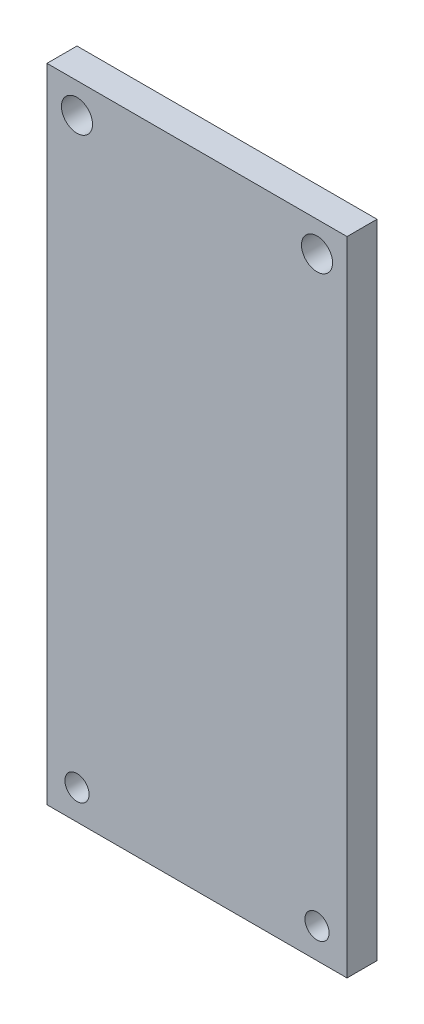
ISO-10303-21;
HEADER;
FILE_DESCRIPTION(('STEP AP214'),'2;1');
FILE_NAME('part.step','',(''),(''),'','','');
FILE_SCHEMA(('AUTOMOTIVE_DESIGN { 1 0 10303 214 1 1 1 1 }'));
ENDSEC;
DATA;
#1=APPLICATION_CONTEXT('core data for automotive mechanical design processes');
#2=APPLICATION_PROTOCOL_DEFINITION('international standard','automotive_design',2000,#1);
#3=PRODUCT_CONTEXT('',#1,'mechanical');
#4=PRODUCT('Part','Part','',(#3));
#5=PRODUCT_RELATED_PRODUCT_CATEGORY('part','',(#4));
#6=PRODUCT_DEFINITION_FORMATION('','',#4);
#7=PRODUCT_DEFINITION_CONTEXT('part definition',#1,'design');
#8=PRODUCT_DEFINITION('design','',#6,#7);
#9=PRODUCT_DEFINITION_SHAPE('','',#8);
#10=(LENGTH_UNIT() NAMED_UNIT(*) SI_UNIT(.MILLI.,.METRE.));
#11=(NAMED_UNIT(*) PLANE_ANGLE_UNIT() SI_UNIT($,.RADIAN.));
#12=(NAMED_UNIT(*) SI_UNIT($,.STERADIAN.) SOLID_ANGLE_UNIT());
#13=UNCERTAINTY_MEASURE_WITH_UNIT(LENGTH_MEASURE(1.E-05),#10,'distance_accuracy_value','');
#14=(GEOMETRIC_REPRESENTATION_CONTEXT(3) GLOBAL_UNCERTAINTY_ASSIGNED_CONTEXT((#13)) GLOBAL_UNIT_ASSIGNED_CONTEXT((#10,
#11,#12)) REPRESENTATION_CONTEXT('',''));
#15=CARTESIAN_POINT('',(0.,0.,0.));
#16=DIRECTION('',(0.,0.,1.));
#17=DIRECTION('',(1.,0.,0.));
#18=AXIS2_PLACEMENT_3D('',#15,#16,#17);
#19=CARTESIAN_POINT('',(0.,0.,3.));
#20=DIRECTION('',(0.,0.,1.));
#21=DIRECTION('',(1.,0.,0.));
#22=AXIS2_PLACEMENT_3D('',#19,#20,#21);
#23=PLANE('',#22);
#24=CARTESIAN_POINT('',(19.5789473684211,-12.5,3.));
#25=DIRECTION('',(0.,0.,1.));
#26=DIRECTION('',(-1.,0.,0.));
#27=AXIS2_PLACEMENT_3D('',#24,#25,#26);
#28=CIRCLE('',#27,1.21166994033908);
#29=CARTESIAN_POINT('',(18.367277428082,-12.5,3.));
#30=VERTEX_POINT('',#29);
#31=EDGE_CURVE('E123',#30,#30,#28,.T.);
#32=ORIENTED_EDGE('',*,*,#31,.F.);
#33=EDGE_LOOP('',(#32));
#34=FACE_BOUND('',#33,.T.);
#35=CARTESIAN_POINT('',(-4.42105263157895,45.7,3.));
#36=DIRECTION('',(0.,0.,1.));
#37=DIRECTION('',(1.,0.,0.));
#38=AXIS2_PLACEMENT_3D('',#35,#36,#37);
#39=CIRCLE('',#38,1.5541919010772);
#40=CARTESIAN_POINT('',(-2.86686073050176,45.7,3.));
#41=VERTEX_POINT('',#40);
#42=EDGE_CURVE('E102',#41,#41,#39,.T.);
#43=ORIENTED_EDGE('',*,*,#42,.F.);
#44=EDGE_LOOP('',(#43));
#45=FACE_BOUND('',#44,.T.);
#46=DIRECTION('',(0.,-1.,0.));
#47=VECTOR('',#46,1.);
#48=CARTESIAN_POINT('',(-7.42105263157895,48.7,3.));
#49=LINE('',#48,#47);
#50=CARTESIAN_POINT('',(-7.42105263157895,48.7,3.));
#51=VERTEX_POINT('',#50);
#52=CARTESIAN_POINT('',(-7.42105263157894,-15.5,3.));
#53=VERTEX_POINT('',#52);
#54=EDGE_CURVE('E87',#51,#53,#49,.T.);
#55=ORIENTED_EDGE('',*,*,#54,.T.);
#56=DIRECTION('',(1.,0.,0.));
#57=VECTOR('',#56,1.);
#58=CARTESIAN_POINT('',(-7.42105263157894,-15.5,3.));
#59=LINE('',#58,#57);
#60=CARTESIAN_POINT('',(22.5789473684211,-15.5,3.));
#61=VERTEX_POINT('',#60);
#62=EDGE_CURVE('E82',#53,#61,#59,.T.);
#63=ORIENTED_EDGE('',*,*,#62,.T.);
#64=DIRECTION('',(0.,1.,0.));
#65=VECTOR('',#64,1.);
#66=CARTESIAN_POINT('',(22.578947368421,48.7,3.));
#67=LINE('',#66,#65);
#68=CARTESIAN_POINT('',(22.578947368421,48.7,3.));
#69=VERTEX_POINT('',#68);
#70=EDGE_CURVE('E85',#61,#69,#67,.T.);
#71=ORIENTED_EDGE('',*,*,#70,.T.);
#72=DIRECTION('',(-1.,0.,0.));
#73=VECTOR('',#72,1.);
#74=CARTESIAN_POINT('',(-7.42105263157895,48.7,3.));
#75=LINE('',#74,#73);
#76=EDGE_CURVE('E52',#69,#51,#75,.T.);
#77=ORIENTED_EDGE('',*,*,#76,.T.);
#78=EDGE_LOOP('',(#55,#63,#71,#77));
#79=FACE_BOUND('',#78,.T.);
#80=CARTESIAN_POINT('',(-4.42105263157894,-12.5,3.));
#81=DIRECTION('',(0.,0.,1.));
#82=DIRECTION('',(1.,0.,0.));
#83=AXIS2_PLACEMENT_3D('',#80,#81,#82);
#84=CIRCLE('',#83,1.21166994033908);
#85=CARTESIAN_POINT('',(-3.20938269123986,-12.5,3.));
#86=VERTEX_POINT('',#85);
#87=EDGE_CURVE('E117',#86,#86,#84,.T.);
#88=ORIENTED_EDGE('',*,*,#87,.F.);
#89=EDGE_LOOP('',(#88));
#90=FACE_BOUND('',#89,.T.);
#91=CARTESIAN_POINT('',(19.5789473684211,45.7,3.));
#92=DIRECTION('',(0.,0.,1.));
#93=DIRECTION('',(-1.,0.,0.));
#94=AXIS2_PLACEMENT_3D('',#91,#92,#93);
#95=CIRCLE('',#94,1.5541919010772);
#96=CARTESIAN_POINT('',(18.0247554673438,45.7,3.));
#97=VERTEX_POINT('',#96);
#98=EDGE_CURVE('E129',#97,#97,#95,.T.);
#99=ORIENTED_EDGE('',*,*,#98,.F.);
#100=EDGE_LOOP('',(#99));
#101=FACE_BOUND('',#100,.T.);
#102=ADVANCED_FACE('F35',(#34,#45,#79,#90,#101),#23,.T.);
#103=CARTESIAN_POINT('',(0.,0.,0.));
#104=DIRECTION('',(0.,0.,1.));
#105=DIRECTION('',(1.,0.,0.));
#106=AXIS2_PLACEMENT_3D('',#103,#104,#105);
#107=PLANE('',#106);
#108=DIRECTION('',(0.,-1.,0.));
#109=VECTOR('',#108,1.);
#110=CARTESIAN_POINT('',(-7.42105263157895,48.7,0.));
#111=LINE('',#110,#109);
#112=CARTESIAN_POINT('',(-7.42105263157895,48.7,0.));
#113=VERTEX_POINT('',#112);
#114=CARTESIAN_POINT('',(-7.42105263157894,-15.5,0.));
#115=VERTEX_POINT('',#114);
#116=EDGE_CURVE('E99',#113,#115,#111,.T.);
#117=ORIENTED_EDGE('',*,*,#116,.F.);
#118=DIRECTION('',(-1.,0.,0.));
#119=VECTOR('',#118,1.);
#120=CARTESIAN_POINT('',(-7.42105263157895,48.7,0.));
#121=LINE('',#120,#119);
#122=CARTESIAN_POINT('',(22.578947368421,48.7,0.));
#123=VERTEX_POINT('',#122);
#124=EDGE_CURVE('E75',#123,#113,#121,.T.);
#125=ORIENTED_EDGE('',*,*,#124,.F.);
#126=DIRECTION('',(0.,1.,0.));
#127=VECTOR('',#126,1.);
#128=CARTESIAN_POINT('',(22.578947368421,48.7,0.));
#129=LINE('',#128,#127);
#130=CARTESIAN_POINT('',(22.5789473684211,-15.5,0.));
#131=VERTEX_POINT('',#130);
#132=EDGE_CURVE('E69',#131,#123,#129,.T.);
#133=ORIENTED_EDGE('',*,*,#132,.F.);
#134=DIRECTION('',(1.,0.,0.));
#135=VECTOR('',#134,1.);
#136=CARTESIAN_POINT('',(-7.42105263157894,-15.5,0.));
#137=LINE('',#136,#135);
#138=EDGE_CURVE('E91',#115,#131,#137,.T.);
#139=ORIENTED_EDGE('',*,*,#138,.F.);
#140=EDGE_LOOP('',(#117,#125,#133,#139));
#141=FACE_BOUND('',#140,.T.);
#142=CARTESIAN_POINT('',(-4.42105263157895,45.7,0.));
#143=DIRECTION('',(0.,0.,1.));
#144=DIRECTION('',(1.,0.,0.));
#145=AXIS2_PLACEMENT_3D('',#142,#143,#144);
#146=CIRCLE('',#145,1.5541919010772);
#147=CARTESIAN_POINT('',(-2.86686073050176,45.7,0.));
#148=VERTEX_POINT('',#147);
#149=EDGE_CURVE('E114',#148,#148,#146,.T.);
#150=ORIENTED_EDGE('',*,*,#149,.T.);
#151=EDGE_LOOP('',(#150));
#152=FACE_BOUND('',#151,.T.);
#153=CARTESIAN_POINT('',(-4.42105263157894,-12.5,0.));
#154=DIRECTION('',(0.,0.,1.));
#155=DIRECTION('',(1.,0.,0.));
#156=AXIS2_PLACEMENT_3D('',#153,#154,#155);
#157=CIRCLE('',#156,1.21166994033908);
#158=CARTESIAN_POINT('',(-3.20938269123986,-12.5,0.));
#159=VERTEX_POINT('',#158);
#160=EDGE_CURVE('E120',#159,#159,#157,.T.);
#161=ORIENTED_EDGE('',*,*,#160,.T.);
#162=EDGE_LOOP('',(#161));
#163=FACE_BOUND('',#162,.T.);
#164=CARTESIAN_POINT('',(19.5789473684211,-12.5,0.));
#165=DIRECTION('',(0.,0.,1.));
#166=DIRECTION('',(-1.,0.,0.));
#167=AXIS2_PLACEMENT_3D('',#164,#165,#166);
#168=CIRCLE('',#167,1.21166994033908);
#169=CARTESIAN_POINT('',(18.367277428082,-12.5,0.));
#170=VERTEX_POINT('',#169);
#171=EDGE_CURVE('E126',#170,#170,#168,.T.);
#172=ORIENTED_EDGE('',*,*,#171,.T.);
#173=EDGE_LOOP('',(#172));
#174=FACE_BOUND('',#173,.T.);
#175=CARTESIAN_POINT('',(19.5789473684211,45.7,0.));
#176=DIRECTION('',(0.,0.,1.));
#177=DIRECTION('',(-1.,0.,0.));
#178=AXIS2_PLACEMENT_3D('',#175,#176,#177);
#179=CIRCLE('',#178,1.5541919010772);
#180=CARTESIAN_POINT('',(18.0247554673438,45.7,0.));
#181=VERTEX_POINT('',#180);
#182=EDGE_CURVE('E132',#181,#181,#179,.T.);
#183=ORIENTED_EDGE('',*,*,#182,.T.);
#184=EDGE_LOOP('',(#183));
#185=FACE_BOUND('',#184,.T.);
#186=ADVANCED_FACE('F110',(#141,#152,#163,#174,#185),#107,.F.);
#187=CARTESIAN_POINT('',(-7.42105263157895,48.7,3.));
#188=DIRECTION('',(1.,0.,0.));
#189=DIRECTION('',(0.,1.,0.));
#190=AXIS2_PLACEMENT_3D('',#187,#188,#189);
#191=PLANE('',#190);
#192=ORIENTED_EDGE('',*,*,#116,.T.);
#193=DIRECTION('',(0.,0.,-1.));
#194=VECTOR('',#193,1.);
#195=CARTESIAN_POINT('',(-7.42105263157894,-15.5,3.));
#196=LINE('',#195,#194);
#197=EDGE_CURVE('E11',#53,#115,#196,.T.);
#198=ORIENTED_EDGE('',*,*,#197,.F.);
#199=ORIENTED_EDGE('',*,*,#54,.F.);
#200=DIRECTION('',(0.,0.,-1.));
#201=VECTOR('',#200,1.);
#202=CARTESIAN_POINT('',(-7.42105263157895,48.7,3.));
#203=LINE('',#202,#201);
#204=EDGE_CURVE('E95',#51,#113,#203,.T.);
#205=ORIENTED_EDGE('',*,*,#204,.T.);
#206=EDGE_LOOP('',(#192,#198,#199,#205));
#207=FACE_BOUND('',#206,.T.);
#208=ADVANCED_FACE('F37',(#207),#191,.F.);
#209=CARTESIAN_POINT('',(-7.42105263157894,-15.5,3.));
#210=DIRECTION('',(0.,1.,0.));
#211=DIRECTION('',(-1.,0.,0.));
#212=AXIS2_PLACEMENT_3D('',#209,#210,#211);
#213=PLANE('',#212);
#214=ORIENTED_EDGE('',*,*,#138,.T.);
#215=DIRECTION('',(0.,0.,-1.));
#216=VECTOR('',#215,1.);
#217=CARTESIAN_POINT('',(22.5789473684211,-15.5,3.));
#218=LINE('',#217,#216);
#219=EDGE_CURVE('E44',#61,#131,#218,.T.);
#220=ORIENTED_EDGE('',*,*,#219,.F.);
#221=ORIENTED_EDGE('',*,*,#62,.F.);
#222=ORIENTED_EDGE('',*,*,#197,.T.);
#223=EDGE_LOOP('',(#214,#220,#221,#222));
#224=FACE_BOUND('',#223,.T.);
#225=ADVANCED_FACE('F90',(#224),#213,.F.);
#226=CARTESIAN_POINT('',(22.578947368421,48.7,3.));
#227=DIRECTION('',(-1.,0.,0.));
#228=DIRECTION('',(0.,-1.,0.));
#229=AXIS2_PLACEMENT_3D('',#226,#227,#228);
#230=PLANE('',#229);
#231=ORIENTED_EDGE('',*,*,#132,.T.);
#232=DIRECTION('',(0.,0.,-1.));
#233=VECTOR('',#232,1.);
#234=CARTESIAN_POINT('',(22.578947368421,48.7,3.));
#235=LINE('',#234,#233);
#236=EDGE_CURVE('E92',#69,#123,#235,.T.);
#237=ORIENTED_EDGE('',*,*,#236,.F.);
#238=ORIENTED_EDGE('',*,*,#70,.F.);
#239=ORIENTED_EDGE('',*,*,#219,.T.);
#240=EDGE_LOOP('',(#231,#237,#238,#239));
#241=FACE_BOUND('',#240,.T.);
#242=ADVANCED_FACE('F93',(#241),#230,.F.);
#243=CARTESIAN_POINT('',(-7.42105263157895,48.7,3.));
#244=DIRECTION('',(0.,-1.,0.));
#245=DIRECTION('',(1.,0.,0.));
#246=AXIS2_PLACEMENT_3D('',#243,#244,#245);
#247=PLANE('',#246);
#248=ORIENTED_EDGE('',*,*,#124,.T.);
#249=ORIENTED_EDGE('',*,*,#204,.F.);
#250=ORIENTED_EDGE('',*,*,#76,.F.);
#251=ORIENTED_EDGE('',*,*,#236,.T.);
#252=EDGE_LOOP('',(#248,#249,#250,#251));
#253=FACE_BOUND('',#252,.T.);
#254=ADVANCED_FACE('F107',(#253),#247,.F.);
#255=CARTESIAN_POINT('',(-4.42105263157895,45.7,3.));
#256=DIRECTION('',(0.,0.,-1.));
#257=DIRECTION('',(-1.,0.,0.));
#258=AXIS2_PLACEMENT_3D('',#255,#256,#257);
#259=CYLINDRICAL_SURFACE('',#258,1.5541919010772);
#260=ORIENTED_EDGE('',*,*,#42,.T.);
#261=EDGE_LOOP('',(#260));
#262=FACE_BOUND('',#261,.T.);
#263=ORIENTED_EDGE('',*,*,#149,.F.);
#264=EDGE_LOOP('',(#263));
#265=FACE_BOUND('',#264,.T.);
#266=ADVANCED_FACE('F151',(#262,#265),#259,.F.);
#267=CARTESIAN_POINT('',(-4.42105263157894,-12.5,3.));
#268=DIRECTION('',(0.,0.,-1.));
#269=DIRECTION('',(-1.,0.,0.));
#270=AXIS2_PLACEMENT_3D('',#267,#268,#269);
#271=CYLINDRICAL_SURFACE('',#270,1.21166994033908);
#272=ORIENTED_EDGE('',*,*,#87,.T.);
#273=EDGE_LOOP('',(#272));
#274=FACE_BOUND('',#273,.T.);
#275=ORIENTED_EDGE('',*,*,#160,.F.);
#276=EDGE_LOOP('',(#275));
#277=FACE_BOUND('',#276,.T.);
#278=ADVANCED_FACE('F197',(#274,#277),#271,.F.);
#279=CARTESIAN_POINT('',(19.5789473684211,-12.5,3.));
#280=DIRECTION('',(0.,0.,-1.));
#281=DIRECTION('',(-1.,0.,0.));
#282=AXIS2_PLACEMENT_3D('',#279,#280,#281);
#283=CYLINDRICAL_SURFACE('',#282,1.21166994033908);
#284=ORIENTED_EDGE('',*,*,#31,.T.);
#285=EDGE_LOOP('',(#284));
#286=FACE_BOUND('',#285,.T.);
#287=ORIENTED_EDGE('',*,*,#171,.F.);
#288=EDGE_LOOP('',(#287));
#289=FACE_BOUND('',#288,.T.);
#290=ADVANCED_FACE('F205',(#286,#289),#283,.F.);
#291=CARTESIAN_POINT('',(19.5789473684211,45.7,3.));
#292=DIRECTION('',(0.,0.,-1.));
#293=DIRECTION('',(-1.,0.,0.));
#294=AXIS2_PLACEMENT_3D('',#291,#292,#293);
#295=CYLINDRICAL_SURFACE('',#294,1.5541919010772);
#296=ORIENTED_EDGE('',*,*,#98,.T.);
#297=EDGE_LOOP('',(#296));
#298=FACE_BOUND('',#297,.T.);
#299=ORIENTED_EDGE('',*,*,#182,.F.);
#300=EDGE_LOOP('',(#299));
#301=FACE_BOUND('',#300,.T.);
#302=ADVANCED_FACE('F138',(#298,#301),#295,.F.);
#303=CLOSED_SHELL('',(#102,#186,#208,#225,#242,#254,#266,#278,#290,#302));
#304=MANIFOLD_SOLID_BREP('B2',#303);
#305=ADVANCED_BREP_SHAPE_REPRESENTATION('',(#18,#304),#14);
#306=SHAPE_DEFINITION_REPRESENTATION(#9,#305);
ENDSEC;
END-ISO-10303-21;
